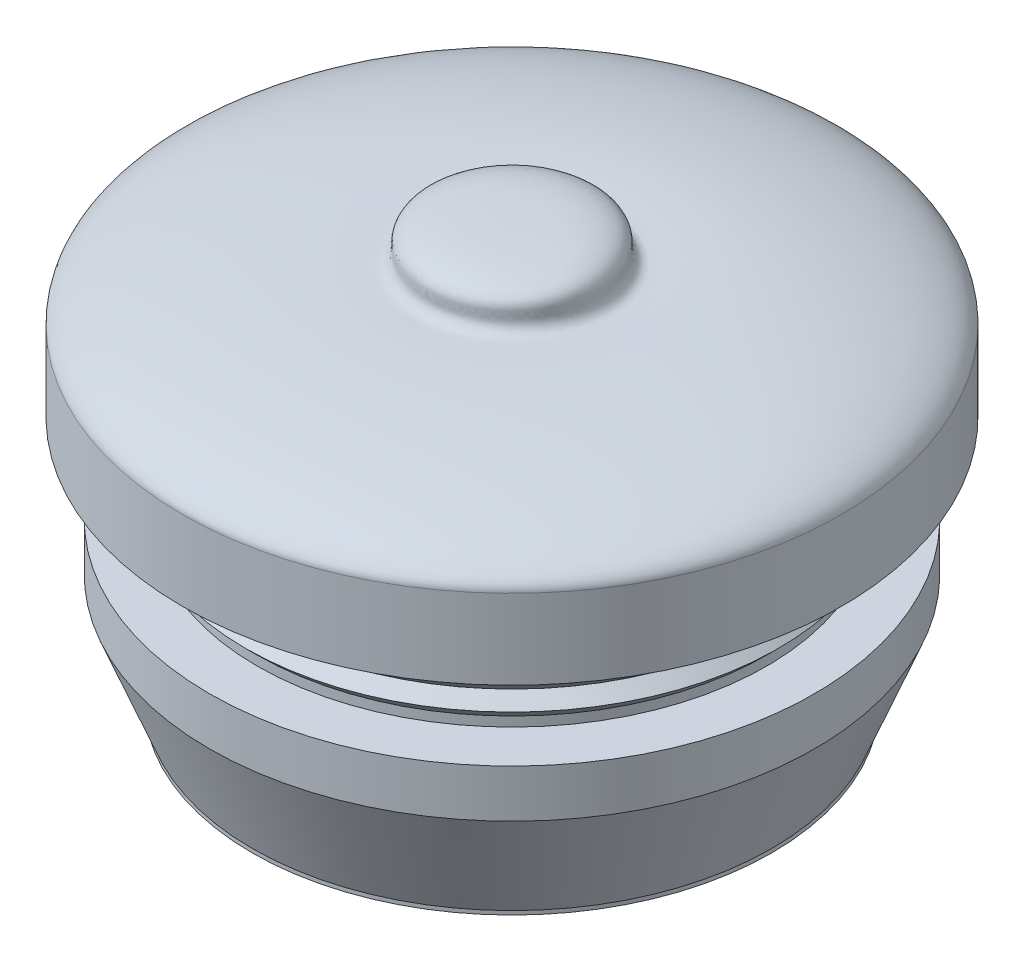
ISO-10303-21;
HEADER;
FILE_DESCRIPTION(('STEP AP214'),'2;1');
FILE_NAME('part.step','',(''),(''),'','','');
FILE_SCHEMA(('AUTOMOTIVE_DESIGN { 1 0 10303 214 1 1 1 1 }'));
ENDSEC;
DATA;
#1=APPLICATION_CONTEXT('core data for automotive mechanical design processes');
#2=APPLICATION_PROTOCOL_DEFINITION('international standard','automotive_design',2000,#1);
#3=PRODUCT_CONTEXT('',#1,'mechanical');
#4=PRODUCT('Part','Part','',(#3));
#5=PRODUCT_RELATED_PRODUCT_CATEGORY('part','',(#4));
#6=PRODUCT_DEFINITION_FORMATION('','',#4);
#7=PRODUCT_DEFINITION_CONTEXT('part definition',#1,'design');
#8=PRODUCT_DEFINITION('design','',#6,#7);
#9=PRODUCT_DEFINITION_SHAPE('','',#8);
#10=(LENGTH_UNIT() NAMED_UNIT(*) SI_UNIT(.MILLI.,.METRE.));
#11=(NAMED_UNIT(*) PLANE_ANGLE_UNIT() SI_UNIT($,.RADIAN.));
#12=(NAMED_UNIT(*) SI_UNIT($,.STERADIAN.) SOLID_ANGLE_UNIT());
#13=UNCERTAINTY_MEASURE_WITH_UNIT(LENGTH_MEASURE(1.E-05),#10,'distance_accuracy_value','');
#14=(GEOMETRIC_REPRESENTATION_CONTEXT(3) GLOBAL_UNCERTAINTY_ASSIGNED_CONTEXT((#13)) GLOBAL_UNIT_ASSIGNED_CONTEXT((#10,
#11,#12)) REPRESENTATION_CONTEXT('',''));
#15=CARTESIAN_POINT('',(0.,0.,0.));
#16=DIRECTION('',(0.,0.,1.));
#17=DIRECTION('',(1.,0.,0.));
#18=AXIS2_PLACEMENT_3D('',#15,#16,#17);
#19=CARTESIAN_POINT('',(0.,-0.0831140392760065,10.35));
#20=DIRECTION('',(0.,-1.,0.));
#21=DIRECTION('',(0.,0.,-1.));
#22=AXIS2_PLACEMENT_3D('',#19,#20,#21);
#23=PLANE('',#22);
#24=CARTESIAN_POINT('',(0.,-0.0831140392760065,0.));
#25=DIRECTION('',(0.,1.,0.));
#26=DIRECTION('',(0.,0.,1.));
#27=AXIS2_PLACEMENT_3D('',#24,#25,#26);
#28=CIRCLE('',#27,8.);
#29=CARTESIAN_POINT('',(0.,-0.0831140392760065,8.));
#30=VERTEX_POINT('',#29);
#31=EDGE_CURVE('E11',#30,#30,#28,.T.);
#32=ORIENTED_EDGE('',*,*,#31,.T.);
#33=EDGE_LOOP('',(#32));
#34=FACE_BOUND('',#33,.T.);
#35=CARTESIAN_POINT('',(0.,-0.0831140392760065,0.));
#36=DIRECTION('',(0.,1.,0.));
#37=DIRECTION('',(0.,0.,1.));
#38=AXIS2_PLACEMENT_3D('',#35,#36,#37);
#39=CIRCLE('',#38,10.35);
#40=CARTESIAN_POINT('',(0.,-0.0831140392760065,10.35));
#41=VERTEX_POINT('',#40);
#42=EDGE_CURVE('E71',#41,#41,#39,.T.);
#43=ORIENTED_EDGE('',*,*,#42,.F.);
#44=EDGE_LOOP('',(#43));
#45=FACE_BOUND('',#44,.T.);
#46=ADVANCED_FACE('F33',(#34,#45),#23,.T.);
#47=CARTESIAN_POINT('',(0.,6.89093536309652,0.));
#48=DIRECTION('',(0.,1.,0.));
#49=DIRECTION('',(0.,0.,1.));
#50=AXIS2_PLACEMENT_3D('',#47,#48,#49);
#51=CYLINDRICAL_SURFACE('',#50,8.);
#52=CARTESIAN_POINT('',(0.,-0.383114039276006,0.));
#53=DIRECTION('',(0.,1.,0.));
#54=DIRECTION('',(0.,0.,1.));
#55=AXIS2_PLACEMENT_3D('',#52,#53,#54);
#56=CIRCLE('',#55,8.);
#57=CARTESIAN_POINT('',(0.,-0.383114039276006,8.));
#58=VERTEX_POINT('',#57);
#59=EDGE_CURVE('E39',#58,#58,#56,.T.);
#60=ORIENTED_EDGE('',*,*,#59,.T.);
#61=EDGE_LOOP('',(#60));
#62=FACE_BOUND('',#61,.T.);
#63=ORIENTED_EDGE('',*,*,#31,.F.);
#64=EDGE_LOOP('',(#63));
#65=FACE_BOUND('',#64,.T.);
#66=ADVANCED_FACE('F60',(#62,#65),#51,.T.);
#67=CARTESIAN_POINT('',(0.,-0.383114039276006,0.));
#68=DIRECTION('',(0.,-1.,0.));
#69=DIRECTION('',(0.,0.,-1.));
#70=AXIS2_PLACEMENT_3D('',#67,#68,#69);
#71=CONICAL_SURFACE('',#70,8.,0.785398163397451);
#72=CARTESIAN_POINT('',(0.,-0.749780705942671,0.));
#73=DIRECTION('',(0.,1.,0.));
#74=DIRECTION('',(0.,0.,1.));
#75=AXIS2_PLACEMENT_3D('',#72,#73,#74);
#76=CIRCLE('',#75,8.36666666666667);
#77=CARTESIAN_POINT('',(0.,-0.749780705942671,8.36666666666667));
#78=VERTEX_POINT('',#77);
#79=EDGE_CURVE('E133',#78,#78,#76,.T.);
#80=ORIENTED_EDGE('',*,*,#79,.T.);
#81=EDGE_LOOP('',(#80));
#82=FACE_BOUND('',#81,.T.);
#83=ORIENTED_EDGE('',*,*,#59,.F.);
#84=EDGE_LOOP('',(#83));
#85=FACE_BOUND('',#84,.T.);
#86=ADVANCED_FACE('F65',(#82,#85),#71,.T.);
#87=CARTESIAN_POINT('',(0.,-0.749780705942671,0.));
#88=DIRECTION('',(0.,1.,0.));
#89=DIRECTION('',(0.,0.,1.));
#90=AXIS2_PLACEMENT_3D('',#87,#88,#89);
#91=CONICAL_SURFACE('',#90,8.36666666666667,0.785398163397445);
#92=CARTESIAN_POINT('',(0.,-1.11644737260934,0.));
#93=DIRECTION('',(0.,1.,0.));
#94=DIRECTION('',(0.,0.,1.));
#95=AXIS2_PLACEMENT_3D('',#92,#93,#94);
#96=CIRCLE('',#95,8.);
#97=CARTESIAN_POINT('',(0.,-1.11644737260934,8.));
#98=VERTEX_POINT('',#97);
#99=EDGE_CURVE('E130',#98,#98,#96,.T.);
#100=ORIENTED_EDGE('',*,*,#99,.T.);
#101=EDGE_LOOP('',(#100));
#102=FACE_BOUND('',#101,.T.);
#103=ORIENTED_EDGE('',*,*,#79,.F.);
#104=EDGE_LOOP('',(#103));
#105=FACE_BOUND('',#104,.T.);
#106=ADVANCED_FACE('F140',(#102,#105),#91,.T.);
#107=CARTESIAN_POINT('',(0.,-1.11644737260934,0.));
#108=DIRECTION('',(0.,-1.,0.));
#109=DIRECTION('',(0.,0.,-1.));
#110=AXIS2_PLACEMENT_3D('',#107,#108,#109);
#111=CONICAL_SURFACE('',#110,8.,0.785398163397451);
#112=CARTESIAN_POINT('',(0.,-1.483114039276,0.));
#113=DIRECTION('',(0.,1.,0.));
#114=DIRECTION('',(0.,0.,1.));
#115=AXIS2_PLACEMENT_3D('',#112,#113,#114);
#116=CIRCLE('',#115,8.36666666666667);
#117=CARTESIAN_POINT('',(0.,-1.483114039276,8.36666666666667));
#118=VERTEX_POINT('',#117);
#119=EDGE_CURVE('E127',#118,#118,#116,.T.);
#120=ORIENTED_EDGE('',*,*,#119,.T.);
#121=EDGE_LOOP('',(#120));
#122=FACE_BOUND('',#121,.T.);
#123=ORIENTED_EDGE('',*,*,#99,.F.);
#124=EDGE_LOOP('',(#123));
#125=FACE_BOUND('',#124,.T.);
#126=ADVANCED_FACE('F146',(#122,#125),#111,.T.);
#127=CARTESIAN_POINT('',(0.,-1.483114039276,0.));
#128=DIRECTION('',(0.,1.,0.));
#129=DIRECTION('',(0.,0.,1.));
#130=AXIS2_PLACEMENT_3D('',#127,#128,#129);
#131=CONICAL_SURFACE('',#130,8.36666666666667,0.785398163397446);
#132=CARTESIAN_POINT('',(0.,-1.84978070594267,0.));
#133=DIRECTION('',(0.,1.,0.));
#134=DIRECTION('',(0.,0.,1.));
#135=AXIS2_PLACEMENT_3D('',#132,#133,#134);
#136=CIRCLE('',#135,8.);
#137=CARTESIAN_POINT('',(0.,-1.84978070594267,8.));
#138=VERTEX_POINT('',#137);
#139=EDGE_CURVE('E124',#138,#138,#136,.T.);
#140=ORIENTED_EDGE('',*,*,#139,.T.);
#141=EDGE_LOOP('',(#140));
#142=FACE_BOUND('',#141,.T.);
#143=ORIENTED_EDGE('',*,*,#119,.F.);
#144=EDGE_LOOP('',(#143));
#145=FACE_BOUND('',#144,.T.);
#146=ADVANCED_FACE('F152',(#142,#145),#131,.T.);
#147=CARTESIAN_POINT('',(0.,-1.84978070594267,0.));
#148=DIRECTION('',(0.,-1.,0.));
#149=DIRECTION('',(0.,0.,-1.));
#150=AXIS2_PLACEMENT_3D('',#147,#148,#149);
#151=CONICAL_SURFACE('',#150,8.,0.785398163397448);
#152=CARTESIAN_POINT('',(0.,-2.21644737260934,0.));
#153=DIRECTION('',(0.,1.,0.));
#154=DIRECTION('',(0.,0.,1.));
#155=AXIS2_PLACEMENT_3D('',#152,#153,#154);
#156=CIRCLE('',#155,8.36666666666667);
#157=CARTESIAN_POINT('',(0.,-2.21644737260934,8.36666666666667));
#158=VERTEX_POINT('',#157);
#159=EDGE_CURVE('E121',#158,#158,#156,.T.);
#160=ORIENTED_EDGE('',*,*,#159,.T.);
#161=EDGE_LOOP('',(#160));
#162=FACE_BOUND('',#161,.T.);
#163=ORIENTED_EDGE('',*,*,#139,.F.);
#164=EDGE_LOOP('',(#163));
#165=FACE_BOUND('',#164,.T.);
#166=ADVANCED_FACE('F156',(#162,#165),#151,.T.);
#167=CARTESIAN_POINT('',(0.,-2.21644737260934,0.));
#168=DIRECTION('',(0.,1.,0.));
#169=DIRECTION('',(0.,0.,1.));
#170=AXIS2_PLACEMENT_3D('',#167,#168,#169);
#171=CONICAL_SURFACE('',#170,8.36666666666667,0.785398163397446);
#172=CARTESIAN_POINT('',(0.,-2.58311403927601,0.));
#173=DIRECTION('',(0.,1.,0.));
#174=DIRECTION('',(0.,0.,1.));
#175=AXIS2_PLACEMENT_3D('',#172,#173,#174);
#176=CIRCLE('',#175,8.);
#177=CARTESIAN_POINT('',(0.,-2.58311403927601,8.));
#178=VERTEX_POINT('',#177);
#179=EDGE_CURVE('E118',#178,#178,#176,.T.);
#180=ORIENTED_EDGE('',*,*,#179,.T.);
#181=EDGE_LOOP('',(#180));
#182=FACE_BOUND('',#181,.T.);
#183=ORIENTED_EDGE('',*,*,#159,.F.);
#184=EDGE_LOOP('',(#183));
#185=FACE_BOUND('',#184,.T.);
#186=ADVANCED_FACE('F160',(#182,#185),#171,.T.);
#187=CARTESIAN_POINT('',(0.,6.89093536309652,0.));
#188=DIRECTION('',(0.,1.,0.));
#189=DIRECTION('',(0.,0.,1.));
#190=AXIS2_PLACEMENT_3D('',#187,#188,#189);
#191=CYLINDRICAL_SURFACE('',#190,8.);
#192=CARTESIAN_POINT('',(0.,-2.88311403927601,0.));
#193=DIRECTION('',(0.,1.,0.));
#194=DIRECTION('',(0.,0.,1.));
#195=AXIS2_PLACEMENT_3D('',#192,#193,#194);
#196=CIRCLE('',#195,8.);
#197=CARTESIAN_POINT('',(0.,-2.88311403927601,8.));
#198=VERTEX_POINT('',#197);
#199=EDGE_CURVE('E115',#198,#198,#196,.T.);
#200=ORIENTED_EDGE('',*,*,#199,.T.);
#201=EDGE_LOOP('',(#200));
#202=FACE_BOUND('',#201,.T.);
#203=ORIENTED_EDGE('',*,*,#179,.F.);
#204=EDGE_LOOP('',(#203));
#205=FACE_BOUND('',#204,.T.);
#206=ADVANCED_FACE('F164',(#202,#205),#191,.T.);
#207=CARTESIAN_POINT('',(0.,-2.88311403927601,8.));
#208=DIRECTION('',(0.,1.,0.));
#209=DIRECTION('',(0.,0.,1.));
#210=AXIS2_PLACEMENT_3D('',#207,#208,#209);
#211=PLANE('',#210);
#212=CARTESIAN_POINT('',(0.,-2.88311403927601,0.));
#213=DIRECTION('',(0.,1.,0.));
#214=DIRECTION('',(0.,0.,1.));
#215=AXIS2_PLACEMENT_3D('',#212,#213,#214);
#216=CIRCLE('',#215,9.5);
#217=CARTESIAN_POINT('',(0.,-2.88311403927601,9.5));
#218=VERTEX_POINT('',#217);
#219=EDGE_CURVE('E112',#218,#218,#216,.T.);
#220=ORIENTED_EDGE('',*,*,#219,.T.);
#221=EDGE_LOOP('',(#220));
#222=FACE_BOUND('',#221,.T.);
#223=ORIENTED_EDGE('',*,*,#199,.F.);
#224=EDGE_LOOP('',(#223));
#225=FACE_BOUND('',#224,.T.);
#226=ADVANCED_FACE('F168',(#222,#225),#211,.T.);
#227=CARTESIAN_POINT('',(0.,6.89093536309652,0.));
#228=DIRECTION('',(0.,1.,0.));
#229=DIRECTION('',(0.,0.,1.));
#230=AXIS2_PLACEMENT_3D('',#227,#228,#229);
#231=CYLINDRICAL_SURFACE('',#230,9.5);
#232=CARTESIAN_POINT('',(0.,-4.38311403927601,0.));
#233=DIRECTION('',(0.,1.,0.));
#234=DIRECTION('',(0.,0.,1.));
#235=AXIS2_PLACEMENT_3D('',#232,#233,#234);
#236=CIRCLE('',#235,9.5);
#237=CARTESIAN_POINT('',(0.,-4.38311403927601,9.5));
#238=VERTEX_POINT('',#237);
#239=EDGE_CURVE('E109',#238,#238,#236,.T.);
#240=ORIENTED_EDGE('',*,*,#239,.T.);
#241=EDGE_LOOP('',(#240));
#242=FACE_BOUND('',#241,.T.);
#243=ORIENTED_EDGE('',*,*,#219,.F.);
#244=EDGE_LOOP('',(#243));
#245=FACE_BOUND('',#244,.T.);
#246=ADVANCED_FACE('F172',(#242,#245),#231,.T.);
#247=CARTESIAN_POINT('',(0.,-4.38311403927601,0.));
#248=DIRECTION('',(0.,1.,0.));
#249=DIRECTION('',(0.,0.,1.));
#250=AXIS2_PLACEMENT_3D('',#247,#248,#249);
#251=CONICAL_SURFACE('',#250,9.5,0.377680355614172);
#252=CARTESIAN_POINT('',(0.,-7.76209869069777,0.));
#253=DIRECTION('',(0.,1.,0.));
#254=DIRECTION('',(0.,0.,1.));
#255=AXIS2_PLACEMENT_3D('',#252,#253,#254);
#256=CIRCLE('',#255,8.15947059811682);
#257=CARTESIAN_POINT('',(0.,-7.76209869069777,8.15947059811682));
#258=VERTEX_POINT('',#257);
#259=EDGE_CURVE('E106',#258,#258,#256,.T.);
#260=ORIENTED_EDGE('',*,*,#259,.T.);
#261=EDGE_LOOP('',(#260));
#262=FACE_BOUND('',#261,.T.);
#263=ORIENTED_EDGE('',*,*,#239,.F.);
#264=EDGE_LOOP('',(#263));
#265=FACE_BOUND('',#264,.T.);
#266=ADVANCED_FACE('F176',(#262,#265),#251,.T.);
#267=CARTESIAN_POINT('',(0.,6.89093536309652,0.));
#268=DIRECTION('',(0.,1.,0.));
#269=DIRECTION('',(0.,0.,1.));
#270=AXIS2_PLACEMENT_3D('',#267,#268,#269);
#271=CYLINDRICAL_SURFACE('',#270,8.15947059811682);
#272=CARTESIAN_POINT('',(0.,-7.88311403927601,0.));
#273=DIRECTION('',(0.,1.,0.));
#274=DIRECTION('',(0.,0.,1.));
#275=AXIS2_PLACEMENT_3D('',#272,#273,#274);
#276=CIRCLE('',#275,8.15947059811682);
#277=CARTESIAN_POINT('',(0.,-7.88311403927601,8.15947059811682));
#278=VERTEX_POINT('',#277);
#279=EDGE_CURVE('E103',#278,#278,#276,.T.);
#280=ORIENTED_EDGE('',*,*,#279,.T.);
#281=EDGE_LOOP('',(#280));
#282=FACE_BOUND('',#281,.T.);
#283=ORIENTED_EDGE('',*,*,#259,.F.);
#284=EDGE_LOOP('',(#283));
#285=FACE_BOUND('',#284,.T.);
#286=ADVANCED_FACE('F180',(#282,#285),#271,.T.);
#287=CARTESIAN_POINT('',(0.,-7.88311403927601,8.15947059811682));
#288=DIRECTION('',(0.,-1.,0.));
#289=DIRECTION('',(0.,0.,-1.));
#290=AXIS2_PLACEMENT_3D('',#287,#288,#289);
#291=PLANE('',#290);
#292=CARTESIAN_POINT('',(0.,-7.88311403927601,0.));
#293=DIRECTION('',(0.,1.,0.));
#294=DIRECTION('',(0.,0.,1.));
#295=AXIS2_PLACEMENT_3D('',#292,#293,#294);
#296=CIRCLE('',#295,7.30583237038922);
#297=CARTESIAN_POINT('',(0.,-7.88311403927601,7.30583237038922));
#298=VERTEX_POINT('',#297);
#299=EDGE_CURVE('E100',#298,#298,#296,.T.);
#300=ORIENTED_EDGE('',*,*,#299,.T.);
#301=EDGE_LOOP('',(#300));
#302=FACE_BOUND('',#301,.T.);
#303=ORIENTED_EDGE('',*,*,#279,.F.);
#304=EDGE_LOOP('',(#303));
#305=FACE_BOUND('',#304,.T.);
#306=ADVANCED_FACE('F184',(#302,#305),#291,.T.);
#307=CARTESIAN_POINT('',(0.,6.89093536309652,0.));
#308=DIRECTION('',(0.,1.,0.));
#309=DIRECTION('',(0.,0.,1.));
#310=AXIS2_PLACEMENT_3D('',#307,#308,#309);
#311=CYLINDRICAL_SURFACE('',#310,7.30583237038922);
#312=CARTESIAN_POINT('',(0.,-5.53309898093378,0.));
#313=DIRECTION('',(0.,1.,0.));
#314=DIRECTION('',(0.,0.,1.));
#315=AXIS2_PLACEMENT_3D('',#312,#313,#314);
#316=CIRCLE('',#315,7.30583237038922);
#317=CARTESIAN_POINT('',(0.,-5.53309898093378,7.30583237038922));
#318=VERTEX_POINT('',#317);
#319=EDGE_CURVE('E97',#318,#318,#316,.T.);
#320=ORIENTED_EDGE('',*,*,#319,.T.);
#321=EDGE_LOOP('',(#320));
#322=FACE_BOUND('',#321,.T.);
#323=ORIENTED_EDGE('',*,*,#299,.F.);
#324=EDGE_LOOP('',(#323));
#325=FACE_BOUND('',#324,.T.);
#326=ADVANCED_FACE('F188',(#322,#325),#311,.F.);
#327=CARTESIAN_POINT('',(0.,-5.53309898093378,0.));
#328=DIRECTION('',(0.,1.,0.));
#329=DIRECTION('',(0.,0.,1.));
#330=AXIS2_PLACEMENT_3D('',#327,#328,#329);
#331=CONICAL_SURFACE('',#330,7.30583237038922,0.985549226067159);
#332=CARTESIAN_POINT('',(0.,-7.88311403927601,0.));
#333=DIRECTION('',(0.,1.,0.));
#334=DIRECTION('',(0.,0.,1.));
#335=AXIS2_PLACEMENT_3D('',#332,#333,#334);
#336=CIRCLE('',#335,3.75967709497914);
#337=CARTESIAN_POINT('',(0.,-7.88311403927601,3.75967709497914));
#338=VERTEX_POINT('',#337);
#339=EDGE_CURVE('E94',#338,#338,#336,.T.);
#340=ORIENTED_EDGE('',*,*,#339,.T.);
#341=EDGE_LOOP('',(#340));
#342=FACE_BOUND('',#341,.T.);
#343=ORIENTED_EDGE('',*,*,#319,.F.);
#344=EDGE_LOOP('',(#343));
#345=FACE_BOUND('',#344,.T.);
#346=ADVANCED_FACE('F192',(#342,#345),#331,.T.);
#347=CARTESIAN_POINT('',(0.,-7.88311403927601,0.));
#348=DIRECTION('',(0.,-1.,0.));
#349=DIRECTION('',(0.,0.,-1.));
#350=AXIS2_PLACEMENT_3D('',#347,#348,#349);
#351=CONICAL_SURFACE('',#350,3.75967709497914,0.585247100727737);
#352=CARTESIAN_POINT('',(0.,-7.1711938466149,0.));
#353=DIRECTION('',(0.,1.,0.));
#354=DIRECTION('',(0.,0.,1.));
#355=AXIS2_PLACEMENT_3D('',#352,#353,#354);
#356=CIRCLE('',#355,3.28789200855253);
#357=CARTESIAN_POINT('',(0.,-7.1711938466149,3.28789200855253));
#358=VERTEX_POINT('',#357);
#359=EDGE_CURVE('E91',#358,#358,#356,.T.);
#360=ORIENTED_EDGE('',*,*,#359,.T.);
#361=EDGE_LOOP('',(#360));
#362=FACE_BOUND('',#361,.T.);
#363=ORIENTED_EDGE('',*,*,#339,.F.);
#364=EDGE_LOOP('',(#363));
#365=FACE_BOUND('',#364,.T.);
#366=ADVANCED_FACE('F196',(#362,#365),#351,.F.);
#367=CARTESIAN_POINT('',(0.,-7.1711938466149,0.));
#368=DIRECTION('',(0.,1.,0.));
#369=DIRECTION('',(0.,0.,1.));
#370=AXIS2_PLACEMENT_3D('',#367,#368,#369);
#371=CONICAL_SURFACE('',#370,3.28789200855253,0.98554922606716);
#372=CARTESIAN_POINT('',(0.,-4.92101987236308,0.));
#373=DIRECTION('',(0.,1.,0.));
#374=DIRECTION('',(0.,0.,1.));
#375=AXIS2_PLACEMENT_3D('',#372,#373,#374);
#376=CIRCLE('',#375,6.68338782933785);
#377=CARTESIAN_POINT('',(0.,-4.92101987236308,6.68338782933785));
#378=VERTEX_POINT('',#377);
#379=EDGE_CURVE('E88',#378,#378,#376,.T.);
#380=ORIENTED_EDGE('',*,*,#379,.T.);
#381=EDGE_LOOP('',(#380));
#382=FACE_BOUND('',#381,.T.);
#383=ORIENTED_EDGE('',*,*,#359,.F.);
#384=EDGE_LOOP('',(#383));
#385=FACE_BOUND('',#384,.T.);
#386=ADVANCED_FACE('F200',(#382,#385),#371,.F.);
#387=CARTESIAN_POINT('',(0.,6.89093536309652,0.));
#388=DIRECTION('',(0.,1.,0.));
#389=DIRECTION('',(0.,0.,1.));
#390=AXIS2_PLACEMENT_3D('',#387,#388,#389);
#391=CYLINDRICAL_SURFACE('',#390,6.68338782933785);
#392=CARTESIAN_POINT('',(0.,1.64808739557145,0.));
#393=DIRECTION('',(0.,1.,0.));
#394=DIRECTION('',(0.,0.,1.));
#395=AXIS2_PLACEMENT_3D('',#392,#393,#394);
#396=CIRCLE('',#395,6.68338782933785);
#397=CARTESIAN_POINT('',(0.,1.64808739557145,6.68338782933785));
#398=VERTEX_POINT('',#397);
#399=EDGE_CURVE('E85',#398,#398,#396,.T.);
#400=ORIENTED_EDGE('',*,*,#399,.T.);
#401=EDGE_LOOP('',(#400));
#402=FACE_BOUND('',#401,.T.);
#403=ORIENTED_EDGE('',*,*,#379,.F.);
#404=EDGE_LOOP('',(#403));
#405=FACE_BOUND('',#404,.T.);
#406=ADVANCED_FACE('F204',(#402,#405),#391,.F.);
#407=CARTESIAN_POINT('',(0.,1.64808739557145,0.));
#408=DIRECTION('',(0.,-1.,0.));
#409=DIRECTION('',(0.,0.,-1.));
#410=AXIS2_PLACEMENT_3D('',#407,#408,#409);
#411=CONICAL_SURFACE('',#410,6.68338782933785,1.39877873363711);
#412=CARTESIAN_POINT('',(0.,2.56584582926361,0.));
#413=DIRECTION('',(0.,1.,0.));
#414=DIRECTION('',(0.,0.,1.));
#415=AXIS2_PLACEMENT_3D('',#412,#413,#414);
#416=CIRCLE('',#415,1.40085633811591);
#417=CARTESIAN_POINT('',(0.,2.56584582926361,1.40085633811591));
#418=VERTEX_POINT('',#417);
#419=EDGE_CURVE('E82',#418,#418,#416,.T.);
#420=ORIENTED_EDGE('',*,*,#419,.T.);
#421=EDGE_LOOP('',(#420));
#422=FACE_BOUND('',#421,.T.);
#423=ORIENTED_EDGE('',*,*,#399,.F.);
#424=EDGE_LOOP('',(#423));
#425=FACE_BOUND('',#424,.T.);
#426=ADVANCED_FACE('F208',(#422,#425),#411,.F.);
#427=CARTESIAN_POINT('',(0.,6.89093536309652,0.));
#428=DIRECTION('',(0.,1.,0.));
#429=DIRECTION('',(0.,0.,1.));
#430=AXIS2_PLACEMENT_3D('',#427,#428,#429);
#431=CYLINDRICAL_SURFACE('',#430,1.40085633811591);
#432=CARTESIAN_POINT('',(0.,3.88212435107782,0.));
#433=DIRECTION('',(0.,1.,0.));
#434=DIRECTION('',(0.,0.,1.));
#435=AXIS2_PLACEMENT_3D('',#432,#433,#434);
#436=CIRCLE('',#435,1.40085633811591);
#437=CARTESIAN_POINT('',(0.,3.88212435107782,1.40085633811591));
#438=VERTEX_POINT('',#437);
#439=EDGE_CURVE('E74',#438,#438,#436,.T.);
#440=ORIENTED_EDGE('',*,*,#439,.T.);
#441=EDGE_LOOP('',(#440));
#442=FACE_BOUND('',#441,.T.);
#443=ORIENTED_EDGE('',*,*,#419,.F.);
#444=EDGE_LOOP('',(#443));
#445=FACE_BOUND('',#444,.T.);
#446=ADVANCED_FACE('F54',(#442,#445),#431,.F.);
#447=CARTESIAN_POINT('',(0.,3.88212435107782,1.40085633811591));
#448=DIRECTION('',(0.,-1.,0.));
#449=DIRECTION('',(0.,0.,-1.));
#450=AXIS2_PLACEMENT_3D('',#447,#448,#449);
#451=PLANE('',#450);
#452=ORIENTED_EDGE('',*,*,#439,.F.);
#453=EDGE_LOOP('',(#452));
#454=FACE_BOUND('',#453,.T.);
#455=ADVANCED_FACE('F45',(#454),#451,.T.);
#456=CARTESIAN_POINT('',(0.,5.31688596072399,0.));
#457=CARTESIAN_POINT('',(0.,5.31688596072399,0.492736407753044));
#458=CARTESIAN_POINT('',(0.,5.36022356379531,2.19738743905192));
#459=CARTESIAN_POINT('',(0.,4.75847599620701,2.73113184417158));
#460=CARTESIAN_POINT('',(0.,4.3242237274601,2.61162695598955));
#461=CARTESIAN_POINT('',(0.,4.03381259086313,2.86798437226589));
#462=CARTESIAN_POINT('',(0.,4.2410803942033,5.87405227952932));
#463=CARTESIAN_POINT('',(0.,3.36552270665779,10.35));
#464=CARTESIAN_POINT('',(0.,2.41688596072399,10.35));
#465=B_SPLINE_CURVE_WITH_KNOTS('',3,(#456,#457,#458,#459,#460,#461,#462,#463,#464),
.UNSPECIFIED.,.F.,.F.,(4,1,1,1,1,1,4),(0.,0.132831038448315,0.17623572783989,0.213040922226178,
0.240507637323102,0.265091574443024,1.),.UNSPECIFIED.);
#466=CARTESIAN_POINT('',(0.,6.89093536309652,0.));
#467=DIRECTION('',(0.,1.,0.));
#468=AXIS1_PLACEMENT('',#466,#467);
#469=SURFACE_OF_REVOLUTION('',#465,#468);
#470=CARTESIAN_POINT('',(0.,2.41688596072399,0.));
#471=DIRECTION('',(0.,1.,0.));
#472=DIRECTION('',(0.,0.,1.));
#473=AXIS2_PLACEMENT_3D('',#470,#471,#472);
#474=CIRCLE('',#473,10.35);
#475=CARTESIAN_POINT('',(0.,2.41688596072399,10.35));
#476=VERTEX_POINT('',#475);
#477=EDGE_CURVE('E72',#476,#476,#474,.T.);
#478=ORIENTED_EDGE('',*,*,#477,.T.);
#479=EDGE_LOOP('',(#478));
#480=FACE_BOUND('',#479,.T.);
#481=CARTESIAN_POINT('',(0.,5.31688596072399,0.));
#482=VERTEX_POINT('',#481);
#483=VERTEX_LOOP('',#482);
#484=FACE_BOUND('',#483,.T.);
#485=ADVANCED_FACE('F42',(#480,#484),#469,.F.);
#486=CARTESIAN_POINT('',(0.,6.89093536309652,0.));
#487=DIRECTION('',(0.,1.,0.));
#488=DIRECTION('',(0.,0.,1.));
#489=AXIS2_PLACEMENT_3D('',#486,#487,#488);
#490=CYLINDRICAL_SURFACE('',#489,10.35);
#491=ORIENTED_EDGE('',*,*,#42,.T.);
#492=EDGE_LOOP('',(#491));
#493=FACE_BOUND('',#492,.T.);
#494=ORIENTED_EDGE('',*,*,#477,.F.);
#495=EDGE_LOOP('',(#494));
#496=FACE_BOUND('',#495,.T.);
#497=ADVANCED_FACE('F44',(#493,#496),#490,.T.);
#498=CLOSED_SHELL('',(#46,#66,#86,#106,#126,#146,#166,#186,#206,#226,#246,#266,#286,#306,#326,
#346,#366,#386,#406,#426,#446,#455,#485,#497));
#499=MANIFOLD_SOLID_BREP('B2',#498);
#500=ADVANCED_BREP_SHAPE_REPRESENTATION('',(#18,#499),#14);
#501=SHAPE_DEFINITION_REPRESENTATION(#9,#500);
ENDSEC;
END-ISO-10303-21;
